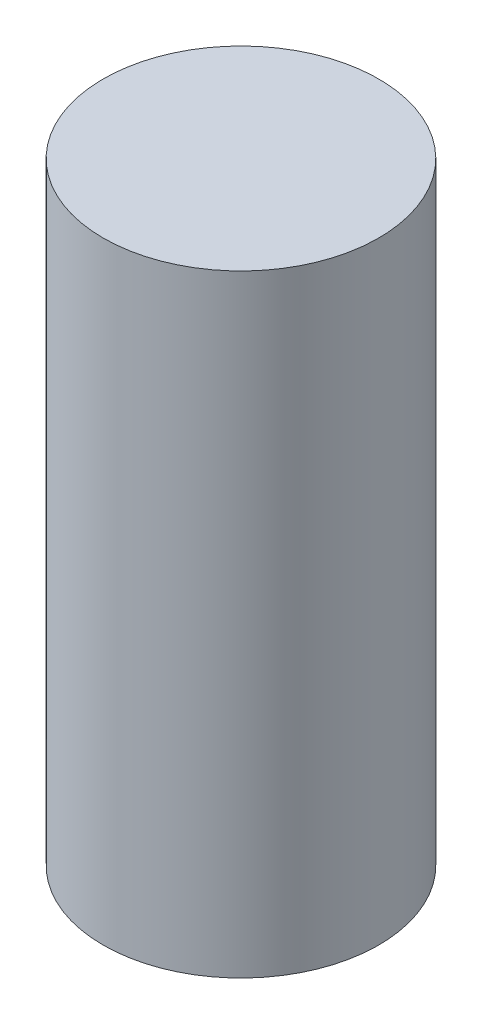
ISO-10303-21;
HEADER;
FILE_DESCRIPTION(('STEP AP214'),'2;1');
FILE_NAME('part.step','',(''),(''),'','','');
FILE_SCHEMA(('AUTOMOTIVE_DESIGN { 1 0 10303 214 1 1 1 1 }'));
ENDSEC;
DATA;
#1=APPLICATION_CONTEXT('core data for automotive mechanical design processes');
#2=APPLICATION_PROTOCOL_DEFINITION('international standard','automotive_design',2000,#1);
#3=PRODUCT_CONTEXT('',#1,'mechanical');
#4=PRODUCT('Part','Part','',(#3));
#5=PRODUCT_RELATED_PRODUCT_CATEGORY('part','',(#4));
#6=PRODUCT_DEFINITION_FORMATION('','',#4);
#7=PRODUCT_DEFINITION_CONTEXT('part definition',#1,'design');
#8=PRODUCT_DEFINITION('design','',#6,#7);
#9=PRODUCT_DEFINITION_SHAPE('','',#8);
#10=(LENGTH_UNIT() NAMED_UNIT(*) SI_UNIT(.MILLI.,.METRE.));
#11=(NAMED_UNIT(*) PLANE_ANGLE_UNIT() SI_UNIT($,.RADIAN.));
#12=(NAMED_UNIT(*) SI_UNIT($,.STERADIAN.) SOLID_ANGLE_UNIT());
#13=UNCERTAINTY_MEASURE_WITH_UNIT(LENGTH_MEASURE(1.E-05),#10,'distance_accuracy_value','');
#14=(GEOMETRIC_REPRESENTATION_CONTEXT(3) GLOBAL_UNCERTAINTY_ASSIGNED_CONTEXT((#13)) GLOBAL_UNIT_ASSIGNED_CONTEXT((#10,
#11,#12)) REPRESENTATION_CONTEXT('',''));
#15=CARTESIAN_POINT('',(0.,0.,0.));
#16=DIRECTION('',(0.,0.,1.));
#17=DIRECTION('',(1.,0.,0.));
#18=AXIS2_PLACEMENT_3D('',#15,#16,#17);
#19=CARTESIAN_POINT('',(0.,-10.,0.));
#20=DIRECTION('',(0.,-1.,0.));
#21=DIRECTION('',(0.,0.,-1.));
#22=AXIS2_PLACEMENT_3D('',#19,#20,#21);
#23=PLANE('',#22);
#24=CARTESIAN_POINT('',(0.,-10.,0.));
#25=DIRECTION('',(0.,1.,0.));
#26=DIRECTION('',(0.,0.,1.));
#27=AXIS2_PLACEMENT_3D('',#24,#25,#26);
#28=CIRCLE('',#27,2.25);
#29=CARTESIAN_POINT('',(0.,-10.,2.25));
#30=VERTEX_POINT('',#29);
#31=EDGE_CURVE('E10',#30,#30,#28,.T.);
#32=ORIENTED_EDGE('',*,*,#31,.F.);
#33=EDGE_LOOP('',(#32));
#34=FACE_BOUND('',#33,.T.);
#35=ADVANCED_FACE('F30',(#34),#23,.T.);
#36=CARTESIAN_POINT('',(0.,4.44467213114755,0.));
#37=DIRECTION('',(0.,1.,0.));
#38=DIRECTION('',(0.,0.,1.));
#39=AXIS2_PLACEMENT_3D('',#36,#37,#38);
#40=CYLINDRICAL_SURFACE('',#39,2.25);
#41=ORIENTED_EDGE('',*,*,#31,.T.);
#42=EDGE_LOOP('',(#41));
#43=FACE_BOUND('',#42,.T.);
#44=CARTESIAN_POINT('',(0.,0.,0.));
#45=DIRECTION('',(0.,1.,0.));
#46=DIRECTION('',(0.,0.,1.));
#47=AXIS2_PLACEMENT_3D('',#44,#45,#46);
#48=CIRCLE('',#47,2.25);
#49=CARTESIAN_POINT('',(0.,0.,2.25));
#50=VERTEX_POINT('',#49);
#51=EDGE_CURVE('E36',#50,#50,#48,.T.);
#52=ORIENTED_EDGE('',*,*,#51,.F.);
#53=EDGE_LOOP('',(#52));
#54=FACE_BOUND('',#53,.T.);
#55=ADVANCED_FACE('F44',(#43,#54),#40,.T.);
#56=CARTESIAN_POINT('',(0.,0.,0.));
#57=DIRECTION('',(0.,1.,0.));
#58=DIRECTION('',(0.,0.,1.));
#59=AXIS2_PLACEMENT_3D('',#56,#57,#58);
#60=PLANE('',#59);
#61=ORIENTED_EDGE('',*,*,#51,.T.);
#62=EDGE_LOOP('',(#61));
#63=FACE_BOUND('',#62,.T.);
#64=ADVANCED_FACE('F42',(#63),#60,.T.);
#65=CLOSED_SHELL('',(#35,#55,#64));
#66=MANIFOLD_SOLID_BREP('B2',#65);
#67=ADVANCED_BREP_SHAPE_REPRESENTATION('',(#18,#66),#14);
#68=SHAPE_DEFINITION_REPRESENTATION(#9,#67);
ENDSEC;
END-ISO-10303-21;
